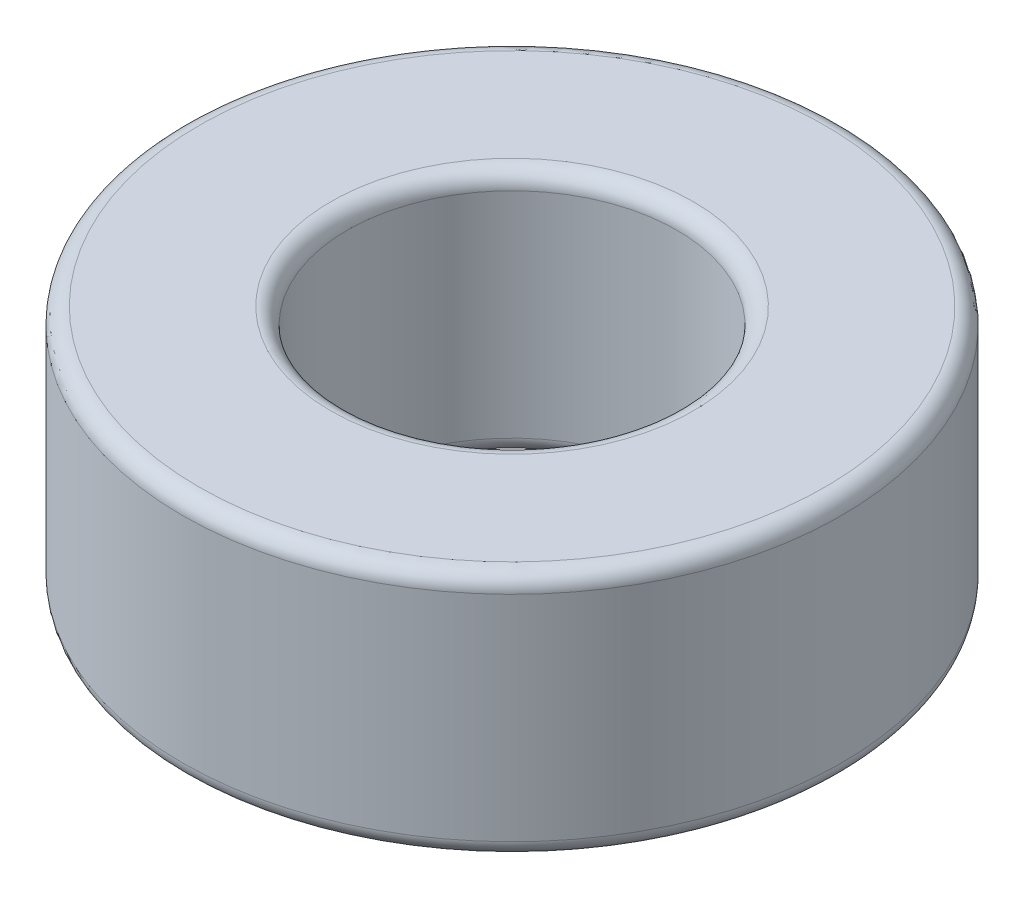
ISO-10303-21;
HEADER;
FILE_DESCRIPTION(('STEP AP214'),'2;1');
FILE_NAME('part.step','',(''),(''),'','','');
FILE_SCHEMA(('AUTOMOTIVE_DESIGN { 1 0 10303 214 1 1 1 1 }'));
ENDSEC;
DATA;
#1=APPLICATION_CONTEXT('core data for automotive mechanical design processes');
#2=APPLICATION_PROTOCOL_DEFINITION('international standard','automotive_design',2000,#1);
#3=PRODUCT_CONTEXT('',#1,'mechanical');
#4=PRODUCT('Part','Part','',(#3));
#5=PRODUCT_RELATED_PRODUCT_CATEGORY('part','',(#4));
#6=PRODUCT_DEFINITION_FORMATION('','',#4);
#7=PRODUCT_DEFINITION_CONTEXT('part definition',#1,'design');
#8=PRODUCT_DEFINITION('design','',#6,#7);
#9=PRODUCT_DEFINITION_SHAPE('','',#8);
#10=(LENGTH_UNIT() NAMED_UNIT(*) SI_UNIT(.MILLI.,.METRE.));
#11=(NAMED_UNIT(*) PLANE_ANGLE_UNIT() SI_UNIT($,.RADIAN.));
#12=(NAMED_UNIT(*) SI_UNIT($,.STERADIAN.) SOLID_ANGLE_UNIT());
#13=UNCERTAINTY_MEASURE_WITH_UNIT(LENGTH_MEASURE(1.E-05),#10,'distance_accuracy_value','');
#14=(GEOMETRIC_REPRESENTATION_CONTEXT(3) GLOBAL_UNCERTAINTY_ASSIGNED_CONTEXT((#13)) GLOBAL_UNIT_ASSIGNED_CONTEXT((#10,
#11,#12)) REPRESENTATION_CONTEXT('',''));
#15=CARTESIAN_POINT('',(0.,0.,0.));
#16=DIRECTION('',(0.,0.,1.));
#17=DIRECTION('',(1.,0.,0.));
#18=AXIS2_PLACEMENT_3D('',#15,#16,#17);
#19=CARTESIAN_POINT('',(0.,15.,0.));
#20=DIRECTION('',(0.,1.,0.));
#21=DIRECTION('',(0.,0.,1.));
#22=AXIS2_PLACEMENT_3D('',#19,#20,#21);
#23=PLANE('',#22);
#24=CARTESIAN_POINT('',(0.,15.,0.));
#25=DIRECTION('',(0.,1.,0.));
#26=DIRECTION('',(0.,0.,1.));
#27=AXIS2_PLACEMENT_3D('',#24,#25,#26);
#28=CIRCLE('',#27,11.);
#29=CARTESIAN_POINT('',(0.,15.,11.));
#30=VERTEX_POINT('',#29);
#31=EDGE_CURVE('E51',#30,#30,#28,.F.);
#32=ORIENTED_EDGE('',*,*,#31,.T.);
#33=EDGE_LOOP('',(#32));
#34=FACE_BOUND('',#33,.T.);
#35=CARTESIAN_POINT('',(0.,15.,0.));
#36=DIRECTION('',(0.,1.,0.));
#37=DIRECTION('',(0.,0.,1.));
#38=AXIS2_PLACEMENT_3D('',#35,#36,#37);
#39=CIRCLE('',#38,19.);
#40=CARTESIAN_POINT('',(0.,15.,19.));
#41=VERTEX_POINT('',#40);
#42=EDGE_CURVE('E60',#41,#41,#39,.T.);
#43=ORIENTED_EDGE('',*,*,#42,.T.);
#44=EDGE_LOOP('',(#43));
#45=FACE_BOUND('',#44,.T.);
#46=ADVANCED_FACE('F31',(#34,#45),#23,.T.);
#47=CARTESIAN_POINT('',(0.,0.,0.));
#48=DIRECTION('',(0.,1.,0.));
#49=DIRECTION('',(0.,0.,1.));
#50=AXIS2_PLACEMENT_3D('',#47,#48,#49);
#51=PLANE('',#50);
#52=CARTESIAN_POINT('',(0.,0.,0.));
#53=DIRECTION('',(0.,1.,0.));
#54=DIRECTION('',(0.,0.,1.));
#55=AXIS2_PLACEMENT_3D('',#52,#53,#54);
#56=CIRCLE('',#55,11.);
#57=CARTESIAN_POINT('',(0.,0.,11.));
#58=VERTEX_POINT('',#57);
#59=EDGE_CURVE('E42',#58,#58,#56,.T.);
#60=ORIENTED_EDGE('',*,*,#59,.T.);
#61=EDGE_LOOP('',(#60));
#62=FACE_BOUND('',#61,.T.);
#63=CARTESIAN_POINT('',(0.,0.,0.));
#64=DIRECTION('',(0.,1.,0.));
#65=DIRECTION('',(0.,0.,1.));
#66=AXIS2_PLACEMENT_3D('',#63,#64,#65);
#67=CIRCLE('',#66,19.);
#68=CARTESIAN_POINT('',(0.,0.,19.));
#69=VERTEX_POINT('',#68);
#70=EDGE_CURVE('E46',#69,#69,#67,.F.);
#71=ORIENTED_EDGE('',*,*,#70,.T.);
#72=EDGE_LOOP('',(#71));
#73=FACE_BOUND('',#72,.T.);
#74=ADVANCED_FACE('F84',(#62,#73),#51,.F.);
#75=CARTESIAN_POINT('',(0.,15.,0.));
#76=DIRECTION('',(0.,-1.,0.));
#77=DIRECTION('',(0.,0.,-1.));
#78=AXIS2_PLACEMENT_3D('',#75,#76,#77);
#79=CYLINDRICAL_SURFACE('',#78,20.);
#80=CARTESIAN_POINT('',(0.,1.,0.));
#81=DIRECTION('',(0.,1.,0.));
#82=DIRECTION('',(0.,0.,1.));
#83=AXIS2_PLACEMENT_3D('',#80,#81,#82);
#84=CIRCLE('',#83,20.);
#85=CARTESIAN_POINT('',(0.,1.,20.));
#86=VERTEX_POINT('',#85);
#87=EDGE_CURVE('E10',#86,#86,#84,.T.);
#88=ORIENTED_EDGE('',*,*,#87,.T.);
#89=EDGE_LOOP('',(#88));
#90=FACE_BOUND('',#89,.T.);
#91=CARTESIAN_POINT('',(0.,14.,0.));
#92=DIRECTION('',(0.,1.,0.));
#93=DIRECTION('',(0.,0.,1.));
#94=AXIS2_PLACEMENT_3D('',#91,#92,#93);
#95=CIRCLE('',#94,20.);
#96=CARTESIAN_POINT('',(0.,14.,20.));
#97=VERTEX_POINT('',#96);
#98=EDGE_CURVE('E57',#97,#97,#95,.F.);
#99=ORIENTED_EDGE('',*,*,#98,.T.);
#100=EDGE_LOOP('',(#99));
#101=FACE_BOUND('',#100,.T.);
#102=ADVANCED_FACE('F79',(#90,#101),#79,.T.);
#103=CARTESIAN_POINT('',(0.,15.,0.));
#104=DIRECTION('',(0.,-1.,0.));
#105=DIRECTION('',(0.,0.,-1.));
#106=AXIS2_PLACEMENT_3D('',#103,#104,#105);
#107=CYLINDRICAL_SURFACE('',#106,10.);
#108=CARTESIAN_POINT('',(0.,1.,0.));
#109=DIRECTION('',(0.,1.,0.));
#110=DIRECTION('',(0.,0.,1.));
#111=AXIS2_PLACEMENT_3D('',#108,#109,#110);
#112=CIRCLE('',#111,10.);
#113=CARTESIAN_POINT('',(0.,1.,10.));
#114=VERTEX_POINT('',#113);
#115=EDGE_CURVE('E38',#114,#114,#112,.F.);
#116=ORIENTED_EDGE('',*,*,#115,.T.);
#117=EDGE_LOOP('',(#116));
#118=FACE_BOUND('',#117,.T.);
#119=CARTESIAN_POINT('',(0.,14.,0.));
#120=DIRECTION('',(0.,1.,0.));
#121=DIRECTION('',(0.,0.,1.));
#122=AXIS2_PLACEMENT_3D('',#119,#120,#121);
#123=CIRCLE('',#122,10.);
#124=CARTESIAN_POINT('',(0.,14.,10.));
#125=VERTEX_POINT('',#124);
#126=EDGE_CURVE('E54',#125,#125,#123,.T.);
#127=ORIENTED_EDGE('',*,*,#126,.T.);
#128=EDGE_LOOP('',(#127));
#129=FACE_BOUND('',#128,.T.);
#130=ADVANCED_FACE('F68',(#118,#129),#107,.F.);
#131=CARTESIAN_POINT('',(0.,14.,0.));
#132=DIRECTION('',(0.,1.,0.));
#133=DIRECTION('',(0.,0.,1.));
#134=AXIS2_PLACEMENT_3D('',#131,#132,#133);
#135=TOROIDAL_SURFACE('',#134,19.,1.);
#136=ORIENTED_EDGE('',*,*,#98,.F.);
#137=EDGE_LOOP('',(#136));
#138=FACE_BOUND('',#137,.T.);
#139=ORIENTED_EDGE('',*,*,#42,.F.);
#140=EDGE_LOOP('',(#139));
#141=FACE_BOUND('',#140,.T.);
#142=ADVANCED_FACE('F65',(#138,#141),#135,.T.);
#143=CARTESIAN_POINT('',(0.,14.,0.));
#144=DIRECTION('',(0.,1.,0.));
#145=DIRECTION('',(0.,0.,1.));
#146=AXIS2_PLACEMENT_3D('',#143,#144,#145);
#147=TOROIDAL_SURFACE('',#146,11.,1.);
#148=ORIENTED_EDGE('',*,*,#31,.F.);
#149=EDGE_LOOP('',(#148));
#150=FACE_BOUND('',#149,.T.);
#151=ORIENTED_EDGE('',*,*,#126,.F.);
#152=EDGE_LOOP('',(#151));
#153=FACE_BOUND('',#152,.T.);
#154=ADVANCED_FACE('F67',(#150,#153),#147,.T.);
#155=CARTESIAN_POINT('',(0.,1.,0.));
#156=DIRECTION('',(0.,1.,0.));
#157=DIRECTION('',(0.,0.,1.));
#158=AXIS2_PLACEMENT_3D('',#155,#156,#157);
#159=TOROIDAL_SURFACE('',#158,11.,1.);
#160=ORIENTED_EDGE('',*,*,#115,.F.);
#161=EDGE_LOOP('',(#160));
#162=FACE_BOUND('',#161,.T.);
#163=ORIENTED_EDGE('',*,*,#59,.F.);
#164=EDGE_LOOP('',(#163));
#165=FACE_BOUND('',#164,.T.);
#166=ADVANCED_FACE('F75',(#162,#165),#159,.T.);
#167=CARTESIAN_POINT('',(0.,1.,0.));
#168=DIRECTION('',(0.,1.,0.));
#169=DIRECTION('',(0.,0.,1.));
#170=AXIS2_PLACEMENT_3D('',#167,#168,#169);
#171=TOROIDAL_SURFACE('',#170,19.,1.);
#172=ORIENTED_EDGE('',*,*,#70,.F.);
#173=EDGE_LOOP('',(#172));
#174=FACE_BOUND('',#173,.T.);
#175=ORIENTED_EDGE('',*,*,#87,.F.);
#176=EDGE_LOOP('',(#175));
#177=FACE_BOUND('',#176,.T.);
#178=ADVANCED_FACE('F33',(#174,#177),#171,.T.);
#179=CLOSED_SHELL('',(#46,#74,#102,#130,#142,#154,#166,#178));
#180=MANIFOLD_SOLID_BREP('B2',#179);
#181=ADVANCED_BREP_SHAPE_REPRESENTATION('',(#18,#180),#14);
#182=SHAPE_DEFINITION_REPRESENTATION(#9,#181);
ENDSEC;
END-ISO-10303-21;
